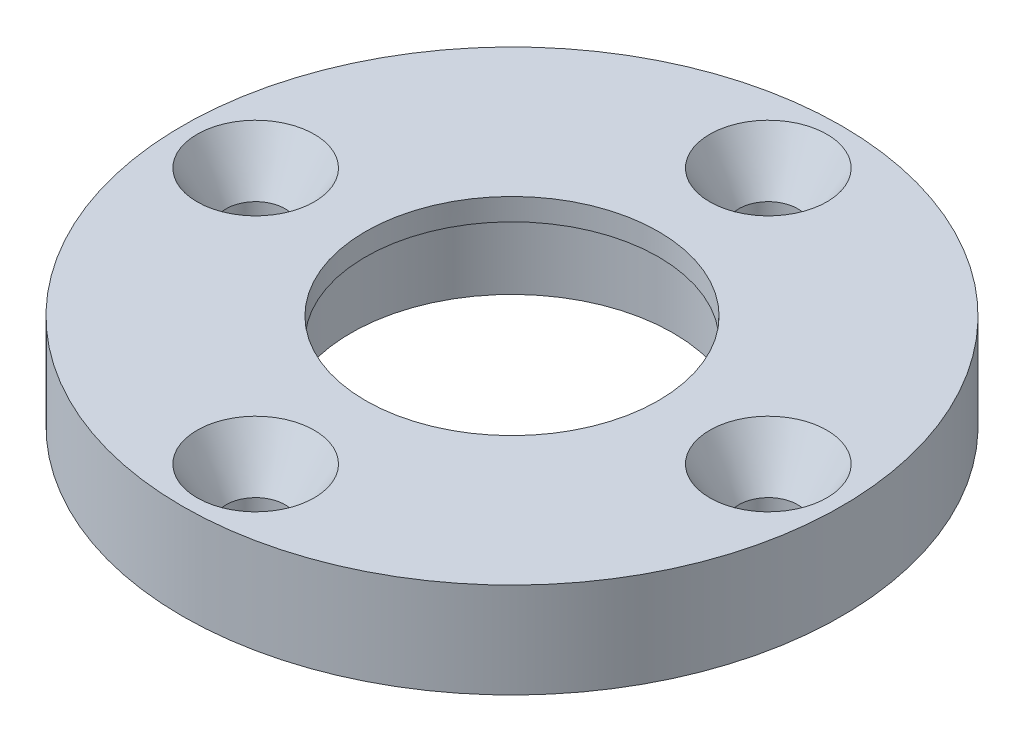
ISO-10303-21;
HEADER;
FILE_DESCRIPTION(('STEP AP214'),'2;1');
FILE_NAME('part.step','',(''),(''),'','','');
FILE_SCHEMA(('AUTOMOTIVE_DESIGN { 1 0 10303 214 1 1 1 1 }'));
ENDSEC;
DATA;
#1=APPLICATION_CONTEXT('core data for automotive mechanical design processes');
#2=APPLICATION_PROTOCOL_DEFINITION('international standard','automotive_design',2000,#1);
#3=PRODUCT_CONTEXT('',#1,'mechanical');
#4=PRODUCT('Part','Part','',(#3));
#5=PRODUCT_RELATED_PRODUCT_CATEGORY('part','',(#4));
#6=PRODUCT_DEFINITION_FORMATION('','',#4);
#7=PRODUCT_DEFINITION_CONTEXT('part definition',#1,'design');
#8=PRODUCT_DEFINITION('design','',#6,#7);
#9=PRODUCT_DEFINITION_SHAPE('','',#8);
#10=(LENGTH_UNIT() NAMED_UNIT(*) SI_UNIT(.MILLI.,.METRE.));
#11=(NAMED_UNIT(*) PLANE_ANGLE_UNIT() SI_UNIT($,.RADIAN.));
#12=(NAMED_UNIT(*) SI_UNIT($,.STERADIAN.) SOLID_ANGLE_UNIT());
#13=UNCERTAINTY_MEASURE_WITH_UNIT(LENGTH_MEASURE(1.E-05),#10,'distance_accuracy_value','');
#14=(GEOMETRIC_REPRESENTATION_CONTEXT(3) GLOBAL_UNCERTAINTY_ASSIGNED_CONTEXT((#13)) GLOBAL_UNIT_ASSIGNED_CONTEXT((#10,
#11,#12)) REPRESENTATION_CONTEXT('',''));
#15=CARTESIAN_POINT('',(0.,0.,0.));
#16=DIRECTION('',(0.,0.,1.));
#17=DIRECTION('',(1.,0.,0.));
#18=AXIS2_PLACEMENT_3D('',#15,#16,#17);
#19=CARTESIAN_POINT('',(0.,6.5,0.));
#20=DIRECTION('',(0.,-1.,0.));
#21=DIRECTION('',(0.,0.,-1.));
#22=AXIS2_PLACEMENT_3D('',#19,#20,#21);
#23=CYLINDRICAL_SURFACE('',#22,10.);
#24=CARTESIAN_POINT('',(0.,6.5,0.));
#25=DIRECTION('',(0.,1.,0.));
#26=DIRECTION('',(0.,0.,1.));
#27=AXIS2_PLACEMENT_3D('',#24,#25,#26);
#28=CIRCLE('',#27,10.);
#29=CARTESIAN_POINT('',(0.,6.5,10.));
#30=VERTEX_POINT('',#29);
#31=EDGE_CURVE('E73',#30,#30,#28,.T.);
#32=ORIENTED_EDGE('',*,*,#31,.T.);
#33=EDGE_LOOP('',(#32));
#34=FACE_BOUND('',#33,.T.);
#35=CARTESIAN_POINT('',(0.,5.,0.));
#36=DIRECTION('',(0.,-1.,0.));
#37=DIRECTION('',(0.,0.,-1.));
#38=AXIS2_PLACEMENT_3D('',#35,#36,#37);
#39=CIRCLE('',#38,10.);
#40=CARTESIAN_POINT('',(0.,5.,-10.));
#41=VERTEX_POINT('',#40);
#42=EDGE_CURVE('E65',#41,#41,#39,.T.);
#43=ORIENTED_EDGE('',*,*,#42,.T.);
#44=EDGE_LOOP('',(#43));
#45=FACE_BOUND('',#44,.T.);
#46=ADVANCED_FACE('F32',(#34,#45),#23,.F.);
#47=CARTESIAN_POINT('',(0.,6.5,0.));
#48=DIRECTION('',(0.,1.,0.));
#49=DIRECTION('',(0.,0.,1.));
#50=AXIS2_PLACEMENT_3D('',#47,#48,#49);
#51=PLANE('',#50);
#52=CARTESIAN_POINT('',(0.,6.5,17.5));
#53=DIRECTION('',(0.,1.,0.));
#54=DIRECTION('',(0.,0.,1.));
#55=AXIS2_PLACEMENT_3D('',#52,#53,#54);
#56=CIRCLE('',#55,4.00000000000004);
#57=CARTESIAN_POINT('',(0.,6.5,21.5));
#58=VERTEX_POINT('',#57);
#59=EDGE_CURVE('E47',#58,#58,#56,.F.);
#60=ORIENTED_EDGE('',*,*,#59,.T.);
#61=EDGE_LOOP('',(#60));
#62=FACE_BOUND('',#61,.T.);
#63=CARTESIAN_POINT('',(17.5,6.5,0.));
#64=DIRECTION('',(0.,1.,0.));
#65=DIRECTION('',(0.,0.,1.));
#66=AXIS2_PLACEMENT_3D('',#63,#64,#65);
#67=CIRCLE('',#66,4.00000000000006);
#68=CARTESIAN_POINT('',(17.5,6.5,4.00000000000012));
#69=VERTEX_POINT('',#68);
#70=EDGE_CURVE('E52',#69,#69,#67,.F.);
#71=ORIENTED_EDGE('',*,*,#70,.T.);
#72=EDGE_LOOP('',(#71));
#73=FACE_BOUND('',#72,.T.);
#74=CARTESIAN_POINT('',(0.,6.5,-17.5));
#75=DIRECTION('',(0.,1.,0.));
#76=DIRECTION('',(0.,0.,1.));
#77=AXIS2_PLACEMENT_3D('',#74,#75,#76);
#78=CIRCLE('',#77,4.00000000000002);
#79=CARTESIAN_POINT('',(0.,6.5,-13.5));
#80=VERTEX_POINT('',#79);
#81=EDGE_CURVE('E55',#80,#80,#78,.F.);
#82=ORIENTED_EDGE('',*,*,#81,.T.);
#83=EDGE_LOOP('',(#82));
#84=FACE_BOUND('',#83,.T.);
#85=CARTESIAN_POINT('',(-17.4999999999998,6.5,2.48689957516035E-13));
#86=DIRECTION('',(0.,1.,0.));
#87=DIRECTION('',(0.,0.,1.));
#88=AXIS2_PLACEMENT_3D('',#85,#86,#87);
#89=CIRCLE('',#88,4.00000000000004);
#90=CARTESIAN_POINT('',(-17.4999999999998,6.5,4.00000000000029));
#91=VERTEX_POINT('',#90);
#92=EDGE_CURVE('E58',#91,#91,#89,.F.);
#93=ORIENTED_EDGE('',*,*,#92,.T.);
#94=EDGE_LOOP('',(#93));
#95=FACE_BOUND('',#94,.T.);
#96=CARTESIAN_POINT('',(0.,6.5,0.));
#97=DIRECTION('',(0.,1.,0.));
#98=DIRECTION('',(0.,0.,1.));
#99=AXIS2_PLACEMENT_3D('',#96,#97,#98);
#100=CIRCLE('',#99,22.5);
#101=CARTESIAN_POINT('',(0.,6.5,22.5));
#102=VERTEX_POINT('',#101);
#103=EDGE_CURVE('E64',#102,#102,#100,.T.);
#104=ORIENTED_EDGE('',*,*,#103,.T.);
#105=EDGE_LOOP('',(#104));
#106=FACE_BOUND('',#105,.T.);
#107=ORIENTED_EDGE('',*,*,#31,.F.);
#108=EDGE_LOOP('',(#107));
#109=FACE_BOUND('',#108,.T.);
#110=ADVANCED_FACE('F108',(#62,#73,#84,#95,#106,#109),#51,.T.);
#111=CARTESIAN_POINT('',(0.,0.,0.));
#112=DIRECTION('',(0.,1.,0.));
#113=DIRECTION('',(0.,0.,1.));
#114=AXIS2_PLACEMENT_3D('',#111,#112,#113);
#115=PLANE('',#114);
#116=CARTESIAN_POINT('',(0.,0.,0.));
#117=DIRECTION('',(0.,-1.,0.));
#118=DIRECTION('',(0.,0.,-1.));
#119=AXIS2_PLACEMENT_3D('',#116,#117,#118);
#120=CIRCLE('',#119,11.);
#121=CARTESIAN_POINT('',(0.,0.,-11.));
#122=VERTEX_POINT('',#121);
#123=EDGE_CURVE('E89',#122,#122,#120,.T.);
#124=ORIENTED_EDGE('',*,*,#123,.F.);
#125=EDGE_LOOP('',(#124));
#126=FACE_BOUND('',#125,.T.);
#127=CARTESIAN_POINT('',(0.,0.,-17.5));
#128=DIRECTION('',(0.,1.,0.));
#129=DIRECTION('',(0.,0.,1.));
#130=AXIS2_PLACEMENT_3D('',#127,#128,#129);
#131=CIRCLE('',#130,2.);
#132=CARTESIAN_POINT('',(0.,0.,-15.5));
#133=VERTEX_POINT('',#132);
#134=EDGE_CURVE('E78',#133,#133,#131,.T.);
#135=ORIENTED_EDGE('',*,*,#134,.T.);
#136=EDGE_LOOP('',(#135));
#137=FACE_BOUND('',#136,.T.);
#138=CARTESIAN_POINT('',(17.5,0.,0.));
#139=DIRECTION('',(0.,1.,0.));
#140=DIRECTION('',(0.,0.,1.));
#141=AXIS2_PLACEMENT_3D('',#138,#139,#140);
#142=CIRCLE('',#141,2.);
#143=CARTESIAN_POINT('',(17.5,0.,2.00000000000006));
#144=VERTEX_POINT('',#143);
#145=EDGE_CURVE('E84',#144,#144,#142,.T.);
#146=ORIENTED_EDGE('',*,*,#145,.T.);
#147=EDGE_LOOP('',(#146));
#148=FACE_BOUND('',#147,.T.);
#149=CARTESIAN_POINT('',(0.,0.,17.5));
#150=DIRECTION('',(0.,1.,0.));
#151=DIRECTION('',(0.,0.,1.));
#152=AXIS2_PLACEMENT_3D('',#149,#150,#151);
#153=CIRCLE('',#152,2.);
#154=CARTESIAN_POINT('',(0.,0.,19.5));
#155=VERTEX_POINT('',#154);
#156=EDGE_CURVE('E81',#155,#155,#153,.T.);
#157=ORIENTED_EDGE('',*,*,#156,.T.);
#158=EDGE_LOOP('',(#157));
#159=FACE_BOUND('',#158,.T.);
#160=CARTESIAN_POINT('',(-17.4999999999998,0.,2.48689957516035E-13));
#161=DIRECTION('',(0.,1.,0.));
#162=DIRECTION('',(0.,0.,1.));
#163=AXIS2_PLACEMENT_3D('',#160,#161,#162);
#164=CIRCLE('',#163,2.);
#165=CARTESIAN_POINT('',(-17.4999999999998,0.,2.00000000000025));
#166=VERTEX_POINT('',#165);
#167=EDGE_CURVE('E68',#166,#166,#164,.T.);
#168=ORIENTED_EDGE('',*,*,#167,.T.);
#169=EDGE_LOOP('',(#168));
#170=FACE_BOUND('',#169,.T.);
#171=CARTESIAN_POINT('',(0.,0.,0.));
#172=DIRECTION('',(0.,1.,0.));
#173=DIRECTION('',(0.,0.,1.));
#174=AXIS2_PLACEMENT_3D('',#171,#172,#173);
#175=CIRCLE('',#174,22.5);
#176=CARTESIAN_POINT('',(0.,0.,22.5));
#177=VERTEX_POINT('',#176);
#178=EDGE_CURVE('E70',#177,#177,#175,.T.);
#179=ORIENTED_EDGE('',*,*,#178,.F.);
#180=EDGE_LOOP('',(#179));
#181=FACE_BOUND('',#180,.T.);
#182=ADVANCED_FACE('F104',(#126,#137,#148,#159,#170,#181),#115,.F.);
#183=CARTESIAN_POINT('',(0.,6.5,0.));
#184=DIRECTION('',(0.,-1.,0.));
#185=DIRECTION('',(0.,0.,-1.));
#186=AXIS2_PLACEMENT_3D('',#183,#184,#185);
#187=CYLINDRICAL_SURFACE('',#186,22.5);
#188=ORIENTED_EDGE('',*,*,#103,.F.);
#189=EDGE_LOOP('',(#188));
#190=FACE_BOUND('',#189,.T.);
#191=ORIENTED_EDGE('',*,*,#178,.T.);
#192=EDGE_LOOP('',(#191));
#193=FACE_BOUND('',#192,.T.);
#194=ADVANCED_FACE('F107',(#190,#193),#187,.T.);
#195=CARTESIAN_POINT('',(-17.4999999999998,0.,2.48689957516035E-13));
#196=DIRECTION('',(0.,1.,0.));
#197=DIRECTION('',(0.,0.,1.));
#198=AXIS2_PLACEMENT_3D('',#195,#196,#197);
#199=CYLINDRICAL_SURFACE('',#198,2.);
#200=CARTESIAN_POINT('',(-17.4999999999998,3.09999999999991,2.48689957516035E-13));
#201=DIRECTION('',(0.,1.,0.));
#202=DIRECTION('',(0.,0.,1.));
#203=AXIS2_PLACEMENT_3D('',#200,#201,#202);
#204=CIRCLE('',#203,2.);
#205=CARTESIAN_POINT('',(-17.4999999999998,3.09999999999991,2.00000000000025));
#206=VERTEX_POINT('',#205);
#207=EDGE_CURVE('E10',#206,#206,#204,.T.);
#208=ORIENTED_EDGE('',*,*,#207,.T.);
#209=EDGE_LOOP('',(#208));
#210=FACE_BOUND('',#209,.T.);
#211=ORIENTED_EDGE('',*,*,#167,.F.);
#212=EDGE_LOOP('',(#211));
#213=FACE_BOUND('',#212,.T.);
#214=ADVANCED_FACE('F121',(#210,#213),#199,.F.);
#215=CARTESIAN_POINT('',(0.,0.,17.5));
#216=DIRECTION('',(0.,1.,0.));
#217=DIRECTION('',(0.,0.,1.));
#218=AXIS2_PLACEMENT_3D('',#215,#216,#217);
#219=CYLINDRICAL_SURFACE('',#218,2.);
#220=CARTESIAN_POINT('',(0.,3.0999999999999,17.5));
#221=DIRECTION('',(0.,1.,0.));
#222=DIRECTION('',(0.,0.,1.));
#223=AXIS2_PLACEMENT_3D('',#220,#221,#222);
#224=CIRCLE('',#223,2.);
#225=CARTESIAN_POINT('',(0.,3.0999999999999,19.5));
#226=VERTEX_POINT('',#225);
#227=EDGE_CURVE('E61',#226,#226,#224,.T.);
#228=ORIENTED_EDGE('',*,*,#227,.T.);
#229=EDGE_LOOP('',(#228));
#230=FACE_BOUND('',#229,.T.);
#231=ORIENTED_EDGE('',*,*,#156,.F.);
#232=EDGE_LOOP('',(#231));
#233=FACE_BOUND('',#232,.T.);
#234=ADVANCED_FACE('F127',(#230,#233),#219,.F.);
#235=CARTESIAN_POINT('',(17.5,0.,0.));
#236=DIRECTION('',(0.,1.,0.));
#237=DIRECTION('',(0.,0.,1.));
#238=AXIS2_PLACEMENT_3D('',#235,#236,#237);
#239=CYLINDRICAL_SURFACE('',#238,2.);
#240=CARTESIAN_POINT('',(17.5,3.09999999999987,0.));
#241=DIRECTION('',(0.,1.,0.));
#242=DIRECTION('',(0.,0.,1.));
#243=AXIS2_PLACEMENT_3D('',#240,#241,#242);
#244=CIRCLE('',#243,2.);
#245=CARTESIAN_POINT('',(17.5,3.09999999999987,2.00000000000006));
#246=VERTEX_POINT('',#245);
#247=EDGE_CURVE('E43',#246,#246,#244,.T.);
#248=ORIENTED_EDGE('',*,*,#247,.T.);
#249=EDGE_LOOP('',(#248));
#250=FACE_BOUND('',#249,.T.);
#251=ORIENTED_EDGE('',*,*,#145,.F.);
#252=EDGE_LOOP('',(#251));
#253=FACE_BOUND('',#252,.T.);
#254=ADVANCED_FACE('F143',(#250,#253),#239,.F.);
#255=CARTESIAN_POINT('',(0.,0.,-17.5));
#256=DIRECTION('',(0.,1.,0.));
#257=DIRECTION('',(0.,0.,1.));
#258=AXIS2_PLACEMENT_3D('',#255,#256,#257);
#259=CYLINDRICAL_SURFACE('',#258,2.);
#260=CARTESIAN_POINT('',(0.,3.09999999999996,-17.5));
#261=DIRECTION('',(0.,1.,0.));
#262=DIRECTION('',(0.,0.,1.));
#263=AXIS2_PLACEMENT_3D('',#260,#261,#262);
#264=CIRCLE('',#263,2.);
#265=CARTESIAN_POINT('',(0.,3.09999999999996,-15.5));
#266=VERTEX_POINT('',#265);
#267=EDGE_CURVE('E39',#266,#266,#264,.T.);
#268=ORIENTED_EDGE('',*,*,#267,.T.);
#269=EDGE_LOOP('',(#268));
#270=FACE_BOUND('',#269,.T.);
#271=ORIENTED_EDGE('',*,*,#134,.F.);
#272=EDGE_LOOP('',(#271));
#273=FACE_BOUND('',#272,.T.);
#274=ADVANCED_FACE('F100',(#270,#273),#259,.F.);
#275=CARTESIAN_POINT('',(0.,5.,0.));
#276=DIRECTION('',(0.,-1.,0.));
#277=DIRECTION('',(0.,0.,-1.));
#278=AXIS2_PLACEMENT_3D('',#275,#276,#277);
#279=CYLINDRICAL_SURFACE('',#278,11.);
#280=CARTESIAN_POINT('',(0.,5.,0.));
#281=DIRECTION('',(0.,-1.,0.));
#282=DIRECTION('',(0.,0.,-1.));
#283=AXIS2_PLACEMENT_3D('',#280,#281,#282);
#284=CIRCLE('',#283,11.);
#285=CARTESIAN_POINT('',(0.,5.,-11.));
#286=VERTEX_POINT('',#285);
#287=EDGE_CURVE('E69',#286,#286,#284,.T.);
#288=ORIENTED_EDGE('',*,*,#287,.F.);
#289=EDGE_LOOP('',(#288));
#290=FACE_BOUND('',#289,.T.);
#291=ORIENTED_EDGE('',*,*,#123,.T.);
#292=EDGE_LOOP('',(#291));
#293=FACE_BOUND('',#292,.T.);
#294=ADVANCED_FACE('F97',(#290,#293),#279,.F.);
#295=CARTESIAN_POINT('',(0.,5.,0.));
#296=DIRECTION('',(0.,-1.,0.));
#297=DIRECTION('',(0.,0.,-1.));
#298=AXIS2_PLACEMENT_3D('',#295,#296,#297);
#299=PLANE('',#298);
#300=ORIENTED_EDGE('',*,*,#42,.F.);
#301=EDGE_LOOP('',(#300));
#302=FACE_BOUND('',#301,.T.);
#303=ORIENTED_EDGE('',*,*,#287,.T.);
#304=EDGE_LOOP('',(#303));
#305=FACE_BOUND('',#304,.T.);
#306=ADVANCED_FACE('F95',(#302,#305),#299,.T.);
#307=CARTESIAN_POINT('',(0.,3.0999999999999,17.5));
#308=DIRECTION('',(0.,1.,0.));
#309=DIRECTION('',(0.,0.,1.));
#310=AXIS2_PLACEMENT_3D('',#307,#308,#309);
#311=CONICAL_SURFACE('',#310,2.,0.531724067258802);
#312=ORIENTED_EDGE('',*,*,#59,.F.);
#313=EDGE_LOOP('',(#312));
#314=FACE_BOUND('',#313,.T.);
#315=ORIENTED_EDGE('',*,*,#227,.F.);
#316=EDGE_LOOP('',(#315));
#317=FACE_BOUND('',#316,.T.);
#318=ADVANCED_FACE('F151',(#314,#317),#311,.F.);
#319=CARTESIAN_POINT('',(17.5,3.09999999999987,0.));
#320=DIRECTION('',(0.,1.,0.));
#321=DIRECTION('',(0.,0.,1.));
#322=AXIS2_PLACEMENT_3D('',#319,#320,#321);
#323=CONICAL_SURFACE('',#322,2.,0.531724067258802);
#324=ORIENTED_EDGE('',*,*,#70,.F.);
#325=EDGE_LOOP('',(#324));
#326=FACE_BOUND('',#325,.T.);
#327=ORIENTED_EDGE('',*,*,#247,.F.);
#328=EDGE_LOOP('',(#327));
#329=FACE_BOUND('',#328,.T.);
#330=ADVANCED_FACE('F156',(#326,#329),#323,.F.);
#331=CARTESIAN_POINT('',(0.,3.09999999999996,-17.5));
#332=DIRECTION('',(0.,1.,0.));
#333=DIRECTION('',(0.,0.,1.));
#334=AXIS2_PLACEMENT_3D('',#331,#332,#333);
#335=CONICAL_SURFACE('',#334,2.,0.531724067258804);
#336=ORIENTED_EDGE('',*,*,#81,.F.);
#337=EDGE_LOOP('',(#336));
#338=FACE_BOUND('',#337,.T.);
#339=ORIENTED_EDGE('',*,*,#267,.F.);
#340=EDGE_LOOP('',(#339));
#341=FACE_BOUND('',#340,.T.);
#342=ADVANCED_FACE('F162',(#338,#341),#335,.F.);
#343=CARTESIAN_POINT('',(-17.4999999999998,3.09999999999991,2.48689957516035E-13));
#344=DIRECTION('',(0.,1.,0.));
#345=DIRECTION('',(0.,0.,1.));
#346=AXIS2_PLACEMENT_3D('',#343,#344,#345);
#347=CONICAL_SURFACE('',#346,2.,0.531724067258802);
#348=ORIENTED_EDGE('',*,*,#92,.F.);
#349=EDGE_LOOP('',(#348));
#350=FACE_BOUND('',#349,.T.);
#351=ORIENTED_EDGE('',*,*,#207,.F.);
#352=EDGE_LOOP('',(#351));
#353=FACE_BOUND('',#352,.T.);
#354=ADVANCED_FACE('F34',(#350,#353),#347,.F.);
#355=CLOSED_SHELL('',(#46,#110,#182,#194,#214,#234,#254,#274,#294,#306,#318,#330,#342,#354));
#356=MANIFOLD_SOLID_BREP('B2',#355);
#357=ADVANCED_BREP_SHAPE_REPRESENTATION('',(#18,#356),#14);
#358=SHAPE_DEFINITION_REPRESENTATION(#9,#357);
ENDSEC;
END-ISO-10303-21;
